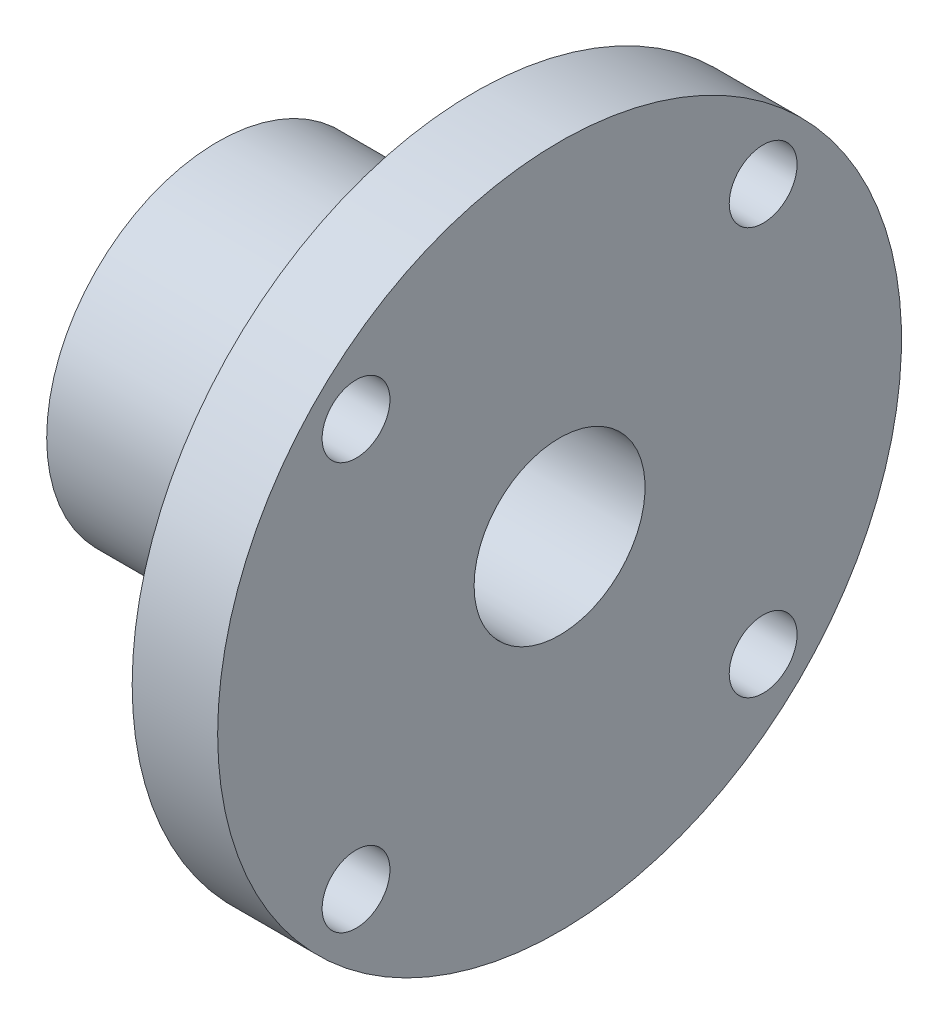
ISO-10303-21;
HEADER;
FILE_DESCRIPTION(('STEP AP214'),'2;1');
FILE_NAME('part.step','',(''),(''),'','','');
FILE_SCHEMA(('AUTOMOTIVE_DESIGN { 1 0 10303 214 1 1 1 1 }'));
ENDSEC;
DATA;
#1=APPLICATION_CONTEXT('core data for automotive mechanical design processes');
#2=APPLICATION_PROTOCOL_DEFINITION('international standard','automotive_design',2000,#1);
#3=PRODUCT_CONTEXT('',#1,'mechanical');
#4=PRODUCT('Part','Part','',(#3));
#5=PRODUCT_RELATED_PRODUCT_CATEGORY('part','',(#4));
#6=PRODUCT_DEFINITION_FORMATION('','',#4);
#7=PRODUCT_DEFINITION_CONTEXT('part definition',#1,'design');
#8=PRODUCT_DEFINITION('design','',#6,#7);
#9=PRODUCT_DEFINITION_SHAPE('','',#8);
#10=(LENGTH_UNIT() NAMED_UNIT(*) SI_UNIT(.MILLI.,.METRE.));
#11=(NAMED_UNIT(*) PLANE_ANGLE_UNIT() SI_UNIT($,.RADIAN.));
#12=(NAMED_UNIT(*) SI_UNIT($,.STERADIAN.) SOLID_ANGLE_UNIT());
#13=UNCERTAINTY_MEASURE_WITH_UNIT(LENGTH_MEASURE(1.E-05),#10,'distance_accuracy_value','');
#14=(GEOMETRIC_REPRESENTATION_CONTEXT(3) GLOBAL_UNCERTAINTY_ASSIGNED_CONTEXT((#13)) GLOBAL_UNIT_ASSIGNED_CONTEXT((#10,
#11,#12)) REPRESENTATION_CONTEXT('',''));
#15=CARTESIAN_POINT('',(0.,0.,0.));
#16=DIRECTION('',(0.,0.,1.));
#17=DIRECTION('',(1.,0.,0.));
#18=AXIS2_PLACEMENT_3D('',#15,#16,#17);
#19=CARTESIAN_POINT('',(-16.,-8.,0.));
#20=DIRECTION('',(-1.,0.,0.));
#21=DIRECTION('',(0.,0.,1.));
#22=AXIS2_PLACEMENT_3D('',#19,#20,#21);
#23=PLANE('',#22);
#24=CARTESIAN_POINT('',(-16.,0.,0.));
#25=DIRECTION('',(-1.,0.,0.));
#26=DIRECTION('',(0.,0.,1.));
#27=AXIS2_PLACEMENT_3D('',#24,#25,#26);
#28=CIRCLE('',#27,8.);
#29=CARTESIAN_POINT('',(-16.,0.,8.));
#30=VERTEX_POINT('',#29);
#31=EDGE_CURVE('E61',#30,#30,#28,.T.);
#32=ORIENTED_EDGE('',*,*,#31,.T.);
#33=EDGE_LOOP('',(#32));
#34=FACE_BOUND('',#33,.T.);
#35=CARTESIAN_POINT('',(-16.,0.,0.));
#36=DIRECTION('',(-1.,0.,0.));
#37=DIRECTION('',(0.,0.,1.));
#38=AXIS2_PLACEMENT_3D('',#35,#36,#37);
#39=CIRCLE('',#38,4.);
#40=CARTESIAN_POINT('',(-16.,0.,4.));
#41=VERTEX_POINT('',#40);
#42=EDGE_CURVE('E10',#41,#41,#39,.T.);
#43=ORIENTED_EDGE('',*,*,#42,.F.);
#44=EDGE_LOOP('',(#43));
#45=FACE_BOUND('',#44,.T.);
#46=ADVANCED_FACE('F39',(#34,#45),#23,.T.);
#47=CARTESIAN_POINT('',(-12.310421286031,0.,0.));
#48=DIRECTION('',(-1.,0.,0.));
#49=DIRECTION('',(0.,0.,1.));
#50=AXIS2_PLACEMENT_3D('',#47,#48,#49);
#51=CYLINDRICAL_SURFACE('',#50,4.);
#52=ORIENTED_EDGE('',*,*,#42,.T.);
#53=EDGE_LOOP('',(#52));
#54=FACE_BOUND('',#53,.T.);
#55=CARTESIAN_POINT('',(0.,0.,0.));
#56=DIRECTION('',(-1.,0.,0.));
#57=DIRECTION('',(0.,0.,1.));
#58=AXIS2_PLACEMENT_3D('',#55,#56,#57);
#59=CIRCLE('',#58,4.);
#60=CARTESIAN_POINT('',(0.,0.,4.));
#61=VERTEX_POINT('',#60);
#62=EDGE_CURVE('E45',#61,#61,#59,.T.);
#63=ORIENTED_EDGE('',*,*,#62,.F.);
#64=EDGE_LOOP('',(#63));
#65=FACE_BOUND('',#64,.T.);
#66=ADVANCED_FACE('F120',(#54,#65),#51,.F.);
#67=CARTESIAN_POINT('',(0.,-4.,0.));
#68=DIRECTION('',(1.,0.,0.));
#69=DIRECTION('',(0.,0.,-1.));
#70=AXIS2_PLACEMENT_3D('',#67,#68,#69);
#71=PLANE('',#70);
#72=CARTESIAN_POINT('',(0.,9.525,9.525));
#73=DIRECTION('',(1.,0.,0.));
#74=DIRECTION('',(0.,0.,-1.));
#75=AXIS2_PLACEMENT_3D('',#72,#73,#74);
#76=CIRCLE('',#75,1.5875);
#77=CARTESIAN_POINT('',(0.,9.525,7.9375));
#78=VERTEX_POINT('',#77);
#79=EDGE_CURVE('E74',#78,#78,#76,.F.);
#80=ORIENTED_EDGE('',*,*,#79,.T.);
#81=EDGE_LOOP('',(#80));
#82=FACE_BOUND('',#81,.T.);
#83=CARTESIAN_POINT('',(0.,-9.525,9.525));
#84=DIRECTION('',(1.,0.,0.));
#85=DIRECTION('',(0.,0.,-1.));
#86=AXIS2_PLACEMENT_3D('',#83,#84,#85);
#87=CIRCLE('',#86,1.5875);
#88=CARTESIAN_POINT('',(0.,-9.525,7.9375));
#89=VERTEX_POINT('',#88);
#90=EDGE_CURVE('E80',#89,#89,#87,.F.);
#91=ORIENTED_EDGE('',*,*,#90,.T.);
#92=EDGE_LOOP('',(#91));
#93=FACE_BOUND('',#92,.T.);
#94=CARTESIAN_POINT('',(0.,-9.525,-9.525));
#95=DIRECTION('',(1.,0.,0.));
#96=DIRECTION('',(0.,0.,-1.));
#97=AXIS2_PLACEMENT_3D('',#94,#95,#96);
#98=CIRCLE('',#97,1.5875);
#99=CARTESIAN_POINT('',(0.,-9.525,-11.1125));
#100=VERTEX_POINT('',#99);
#101=EDGE_CURVE('E68',#100,#100,#98,.F.);
#102=ORIENTED_EDGE('',*,*,#101,.T.);
#103=EDGE_LOOP('',(#102));
#104=FACE_BOUND('',#103,.T.);
#105=CARTESIAN_POINT('',(0.,9.525,-9.525));
#106=DIRECTION('',(1.,0.,0.));
#107=DIRECTION('',(0.,0.,-1.));
#108=AXIS2_PLACEMENT_3D('',#105,#106,#107);
#109=CIRCLE('',#108,1.5875);
#110=CARTESIAN_POINT('',(0.,9.525,-11.1125));
#111=VERTEX_POINT('',#110);
#112=EDGE_CURVE('E65',#111,#111,#109,.F.);
#113=ORIENTED_EDGE('',*,*,#112,.T.);
#114=EDGE_LOOP('',(#113));
#115=FACE_BOUND('',#114,.T.);
#116=ORIENTED_EDGE('',*,*,#62,.T.);
#117=EDGE_LOOP('',(#116));
#118=FACE_BOUND('',#117,.T.);
#119=CARTESIAN_POINT('',(0.,0.,0.));
#120=DIRECTION('',(-1.,0.,0.));
#121=DIRECTION('',(0.,0.,1.));
#122=AXIS2_PLACEMENT_3D('',#119,#120,#121);
#123=CIRCLE('',#122,16.000000004);
#124=CARTESIAN_POINT('',(0.,0.,16.000000004));
#125=VERTEX_POINT('',#124);
#126=EDGE_CURVE('E49',#125,#125,#123,.T.);
#127=ORIENTED_EDGE('',*,*,#126,.F.);
#128=EDGE_LOOP('',(#127));
#129=FACE_BOUND('',#128,.T.);
#130=ADVANCED_FACE('F89',(#82,#93,#104,#115,#118,#129),#71,.T.);
#131=CARTESIAN_POINT('',(-12.310421286031,0.,0.));
#132=DIRECTION('',(-1.,0.,0.));
#133=DIRECTION('',(0.,0.,1.));
#134=AXIS2_PLACEMENT_3D('',#131,#132,#133);
#135=CYLINDRICAL_SURFACE('',#134,16.000000004);
#136=ORIENTED_EDGE('',*,*,#126,.T.);
#137=EDGE_LOOP('',(#136));
#138=FACE_BOUND('',#137,.T.);
#139=CARTESIAN_POINT('',(-4.,0.,0.));
#140=DIRECTION('',(-1.,0.,0.));
#141=DIRECTION('',(0.,0.,1.));
#142=AXIS2_PLACEMENT_3D('',#139,#140,#141);
#143=CIRCLE('',#142,16.000000004);
#144=CARTESIAN_POINT('',(-4.,0.,16.000000004));
#145=VERTEX_POINT('',#144);
#146=EDGE_CURVE('E53',#145,#145,#143,.T.);
#147=ORIENTED_EDGE('',*,*,#146,.F.);
#148=EDGE_LOOP('',(#147));
#149=FACE_BOUND('',#148,.T.);
#150=ADVANCED_FACE('F104',(#138,#149),#135,.T.);
#151=CARTESIAN_POINT('',(-4.,-16.000000004,0.));
#152=DIRECTION('',(-1.,0.,0.));
#153=DIRECTION('',(0.,0.,1.));
#154=AXIS2_PLACEMENT_3D('',#151,#152,#153);
#155=PLANE('',#154);
#156=CARTESIAN_POINT('',(-4.,9.525,9.525));
#157=DIRECTION('',(-1.,0.,0.));
#158=DIRECTION('',(0.,0.,1.));
#159=AXIS2_PLACEMENT_3D('',#156,#157,#158);
#160=CIRCLE('',#159,1.5875);
#161=CARTESIAN_POINT('',(-4.,9.525,11.1125));
#162=VERTEX_POINT('',#161);
#163=EDGE_CURVE('E71',#162,#162,#160,.T.);
#164=ORIENTED_EDGE('',*,*,#163,.F.);
#165=EDGE_LOOP('',(#164));
#166=FACE_BOUND('',#165,.T.);
#167=CARTESIAN_POINT('',(-4.,-9.525,9.525));
#168=DIRECTION('',(-1.,0.,0.));
#169=DIRECTION('',(0.,0.,1.));
#170=AXIS2_PLACEMENT_3D('',#167,#168,#169);
#171=CIRCLE('',#170,1.5875);
#172=CARTESIAN_POINT('',(-4.,-9.525,11.1125));
#173=VERTEX_POINT('',#172);
#174=EDGE_CURVE('E77',#173,#173,#171,.T.);
#175=ORIENTED_EDGE('',*,*,#174,.F.);
#176=EDGE_LOOP('',(#175));
#177=FACE_BOUND('',#176,.T.);
#178=CARTESIAN_POINT('',(-4.,-9.525,-9.525));
#179=DIRECTION('',(-1.,0.,0.));
#180=DIRECTION('',(0.,0.,1.));
#181=AXIS2_PLACEMENT_3D('',#178,#179,#180);
#182=CIRCLE('',#181,1.5875);
#183=CARTESIAN_POINT('',(-4.,-9.525,-7.9375));
#184=VERTEX_POINT('',#183);
#185=EDGE_CURVE('E83',#184,#184,#182,.T.);
#186=ORIENTED_EDGE('',*,*,#185,.F.);
#187=EDGE_LOOP('',(#186));
#188=FACE_BOUND('',#187,.T.);
#189=CARTESIAN_POINT('',(-4.,9.525,-9.525));
#190=DIRECTION('',(-1.,0.,0.));
#191=DIRECTION('',(0.,0.,1.));
#192=AXIS2_PLACEMENT_3D('',#189,#190,#191);
#193=CIRCLE('',#192,1.5875);
#194=CARTESIAN_POINT('',(-4.,9.525,-7.9375));
#195=VERTEX_POINT('',#194);
#196=EDGE_CURVE('E64',#195,#195,#193,.T.);
#197=ORIENTED_EDGE('',*,*,#196,.F.);
#198=EDGE_LOOP('',(#197));
#199=FACE_BOUND('',#198,.T.);
#200=ORIENTED_EDGE('',*,*,#146,.T.);
#201=EDGE_LOOP('',(#200));
#202=FACE_BOUND('',#201,.T.);
#203=CARTESIAN_POINT('',(-4.,0.,0.));
#204=DIRECTION('',(-1.,0.,0.));
#205=DIRECTION('',(0.,0.,1.));
#206=AXIS2_PLACEMENT_3D('',#203,#204,#205);
#207=CIRCLE('',#206,8.);
#208=CARTESIAN_POINT('',(-4.,0.,8.));
#209=VERTEX_POINT('',#208);
#210=EDGE_CURVE('E58',#209,#209,#207,.T.);
#211=ORIENTED_EDGE('',*,*,#210,.F.);
#212=EDGE_LOOP('',(#211));
#213=FACE_BOUND('',#212,.T.);
#214=ADVANCED_FACE('F100',(#166,#177,#188,#199,#202,#213),#155,.T.);
#215=CARTESIAN_POINT('',(-12.310421286031,0.,0.));
#216=DIRECTION('',(-1.,0.,0.));
#217=DIRECTION('',(0.,0.,1.));
#218=AXIS2_PLACEMENT_3D('',#215,#216,#217);
#219=CYLINDRICAL_SURFACE('',#218,8.);
#220=ORIENTED_EDGE('',*,*,#210,.T.);
#221=EDGE_LOOP('',(#220));
#222=FACE_BOUND('',#221,.T.);
#223=ORIENTED_EDGE('',*,*,#31,.F.);
#224=EDGE_LOOP('',(#223));
#225=FACE_BOUND('',#224,.T.);
#226=ADVANCED_FACE('F103',(#222,#225),#219,.T.);
#227=CARTESIAN_POINT('',(0.00100000000000187,9.525,-9.525));
#228=DIRECTION('',(-1.,0.,0.));
#229=DIRECTION('',(0.,0.,1.));
#230=AXIS2_PLACEMENT_3D('',#227,#228,#229);
#231=CYLINDRICAL_SURFACE('',#230,1.5875);
#232=ORIENTED_EDGE('',*,*,#112,.F.);
#233=EDGE_LOOP('',(#232));
#234=FACE_BOUND('',#233,.T.);
#235=ORIENTED_EDGE('',*,*,#196,.T.);
#236=EDGE_LOOP('',(#235));
#237=FACE_BOUND('',#236,.T.);
#238=ADVANCED_FACE('F96',(#234,#237),#231,.F.);
#239=CARTESIAN_POINT('',(0.00100000000000187,-9.525,-9.525));
#240=DIRECTION('',(-1.,0.,0.));
#241=DIRECTION('',(0.,0.,1.));
#242=AXIS2_PLACEMENT_3D('',#239,#240,#241);
#243=CYLINDRICAL_SURFACE('',#242,1.5875);
#244=ORIENTED_EDGE('',*,*,#101,.F.);
#245=EDGE_LOOP('',(#244));
#246=FACE_BOUND('',#245,.T.);
#247=ORIENTED_EDGE('',*,*,#185,.T.);
#248=EDGE_LOOP('',(#247));
#249=FACE_BOUND('',#248,.T.);
#250=ADVANCED_FACE('F92',(#246,#249),#243,.F.);
#251=CARTESIAN_POINT('',(0.00100000000000187,-9.525,9.525));
#252=DIRECTION('',(-1.,0.,0.));
#253=DIRECTION('',(0.,0.,1.));
#254=AXIS2_PLACEMENT_3D('',#251,#252,#253);
#255=CYLINDRICAL_SURFACE('',#254,1.5875);
#256=ORIENTED_EDGE('',*,*,#90,.F.);
#257=EDGE_LOOP('',(#256));
#258=FACE_BOUND('',#257,.T.);
#259=ORIENTED_EDGE('',*,*,#174,.T.);
#260=EDGE_LOOP('',(#259));
#261=FACE_BOUND('',#260,.T.);
#262=ADVANCED_FACE('F95',(#258,#261),#255,.F.);
#263=CARTESIAN_POINT('',(0.00100000000000187,9.525,9.525));
#264=DIRECTION('',(-1.,0.,0.));
#265=DIRECTION('',(0.,0.,1.));
#266=AXIS2_PLACEMENT_3D('',#263,#264,#265);
#267=CYLINDRICAL_SURFACE('',#266,1.5875);
#268=ORIENTED_EDGE('',*,*,#79,.F.);
#269=EDGE_LOOP('',(#268));
#270=FACE_BOUND('',#269,.T.);
#271=ORIENTED_EDGE('',*,*,#163,.T.);
#272=EDGE_LOOP('',(#271));
#273=FACE_BOUND('',#272,.T.);
#274=ADVANCED_FACE('F137',(#270,#273),#267,.F.);
#275=CLOSED_SHELL('',(#46,#66,#130,#150,#214,#226,#238,#250,#262,#274));
#276=MANIFOLD_SOLID_BREP('B2',#275);
#277=ADVANCED_BREP_SHAPE_REPRESENTATION('',(#18,#276),#14);
#278=SHAPE_DEFINITION_REPRESENTATION(#9,#277);
ENDSEC;
END-ISO-10303-21;
